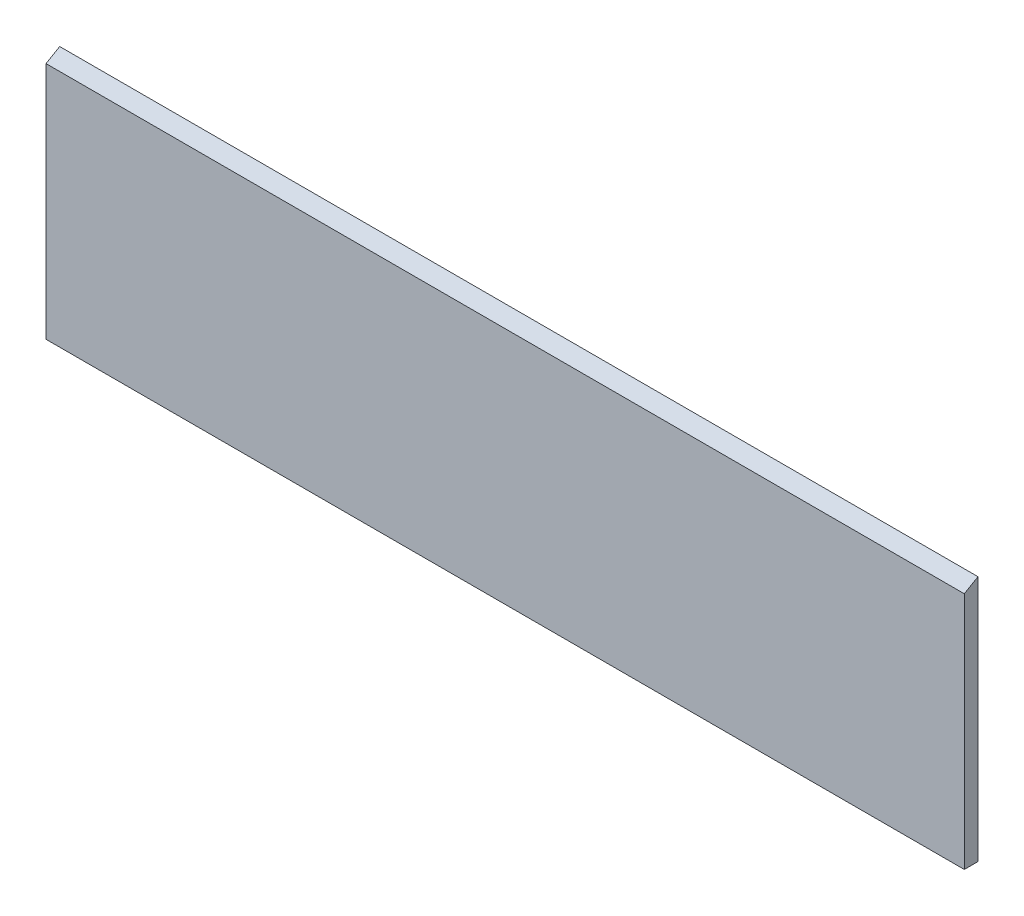
ISO-10303-21;
HEADER;
FILE_DESCRIPTION(('STEP AP214'),'2;1');
FILE_NAME('part.step','',(''),(''),'','','');
FILE_SCHEMA(('AUTOMOTIVE_DESIGN { 1 0 10303 214 1 1 1 1 }'));
ENDSEC;
DATA;
#1=APPLICATION_CONTEXT('core data for automotive mechanical design processes');
#2=APPLICATION_PROTOCOL_DEFINITION('international standard','automotive_design',2000,#1);
#3=PRODUCT_CONTEXT('',#1,'mechanical');
#4=PRODUCT('Part','Part','',(#3));
#5=PRODUCT_RELATED_PRODUCT_CATEGORY('part','',(#4));
#6=PRODUCT_DEFINITION_FORMATION('','',#4);
#7=PRODUCT_DEFINITION_CONTEXT('part definition',#1,'design');
#8=PRODUCT_DEFINITION('design','',#6,#7);
#9=PRODUCT_DEFINITION_SHAPE('','',#8);
#10=(LENGTH_UNIT() NAMED_UNIT(*) SI_UNIT(.MILLI.,.METRE.));
#11=(NAMED_UNIT(*) PLANE_ANGLE_UNIT() SI_UNIT($,.RADIAN.));
#12=(NAMED_UNIT(*) SI_UNIT($,.STERADIAN.) SOLID_ANGLE_UNIT());
#13=UNCERTAINTY_MEASURE_WITH_UNIT(LENGTH_MEASURE(1.E-05),#10,'distance_accuracy_value','');
#14=(GEOMETRIC_REPRESENTATION_CONTEXT(3) GLOBAL_UNCERTAINTY_ASSIGNED_CONTEXT((#13)) GLOBAL_UNIT_ASSIGNED_CONTEXT((#10,
#11,#12)) REPRESENTATION_CONTEXT('',''));
#15=CARTESIAN_POINT('',(0.,0.,0.));
#16=DIRECTION('',(0.,0.,1.));
#17=DIRECTION('',(1.,0.,0.));
#18=AXIS2_PLACEMENT_3D('',#15,#16,#17);
#19=CARTESIAN_POINT('',(0.,0.,10.));
#20=DIRECTION('',(1.,0.,0.));
#21=DIRECTION('',(0.,0.,-1.));
#22=AXIS2_PLACEMENT_3D('',#19,#20,#21);
#23=PLANE('',#22);
#24=DIRECTION('',(0.,-1.,0.));
#25=VECTOR('',#24,1.);
#26=CARTESIAN_POINT('',(0.,0.,10.));
#27=LINE('',#26,#25);
#28=CARTESIAN_POINT('',(0.,174.226497308104,9.99999999999999));
#29=VERTEX_POINT('',#28);
#30=CARTESIAN_POINT('',(0.,0.,10.));
#31=VERTEX_POINT('',#30);
#32=EDGE_CURVE('E88',#29,#31,#27,.T.);
#33=ORIENTED_EDGE('',*,*,#32,.F.);
#34=DIRECTION('',(0.,0.500000000000003,-0.866025403784437));
#35=VECTOR('',#34,1.);
#36=CARTESIAN_POINT('',(0.,180.,0.));
#37=LINE('',#36,#35);
#38=CARTESIAN_POINT('',(0.,180.,0.));
#39=VERTEX_POINT('',#38);
#40=EDGE_CURVE('E77',#29,#39,#37,.T.);
#41=ORIENTED_EDGE('',*,*,#40,.T.);
#42=DIRECTION('',(0.,-1.,0.));
#43=VECTOR('',#42,1.);
#44=CARTESIAN_POINT('',(0.,0.,0.));
#45=LINE('',#44,#43);
#46=CARTESIAN_POINT('',(0.,0.,0.));
#47=VERTEX_POINT('',#46);
#48=EDGE_CURVE('E87',#39,#47,#45,.T.);
#49=ORIENTED_EDGE('',*,*,#48,.T.);
#50=DIRECTION('',(0.,0.,-1.));
#51=VECTOR('',#50,1.);
#52=CARTESIAN_POINT('',(0.,0.,10.));
#53=LINE('',#52,#51);
#54=EDGE_CURVE('E11',#31,#47,#53,.T.);
#55=ORIENTED_EDGE('',*,*,#54,.F.);
#56=EDGE_LOOP('',(#33,#41,#49,#55));
#57=FACE_BOUND('',#56,.T.);
#58=ADVANCED_FACE('F31',(#57),#23,.F.);
#59=CARTESIAN_POINT('',(0.,0.,10.));
#60=DIRECTION('',(0.,1.,0.));
#61=DIRECTION('',(0.,0.,1.));
#62=AXIS2_PLACEMENT_3D('',#59,#60,#61);
#63=PLANE('',#62);
#64=DIRECTION('',(1.,0.,0.));
#65=VECTOR('',#64,1.);
#66=CARTESIAN_POINT('',(0.,0.,0.));
#67=LINE('',#66,#65);
#68=CARTESIAN_POINT('',(670.,0.,0.));
#69=VERTEX_POINT('',#68);
#70=EDGE_CURVE('E58',#47,#69,#67,.T.);
#71=ORIENTED_EDGE('',*,*,#70,.T.);
#72=DIRECTION('',(0.,0.,-1.));
#73=VECTOR('',#72,1.);
#74=CARTESIAN_POINT('',(670.,0.,10.));
#75=LINE('',#74,#73);
#76=CARTESIAN_POINT('',(670.,0.,10.));
#77=VERTEX_POINT('',#76);
#78=EDGE_CURVE('E39',#77,#69,#75,.T.);
#79=ORIENTED_EDGE('',*,*,#78,.F.);
#80=DIRECTION('',(1.,0.,0.));
#81=VECTOR('',#80,1.);
#82=CARTESIAN_POINT('',(0.,0.,10.));
#83=LINE('',#82,#81);
#84=EDGE_CURVE('E47',#31,#77,#83,.T.);
#85=ORIENTED_EDGE('',*,*,#84,.F.);
#86=ORIENTED_EDGE('',*,*,#54,.T.);
#87=EDGE_LOOP('',(#71,#79,#85,#86));
#88=FACE_BOUND('',#87,.T.);
#89=ADVANCED_FACE('F105',(#88),#63,.F.);
#90=CARTESIAN_POINT('',(670.,0.,10.));
#91=DIRECTION('',(-1.,0.,0.));
#92=DIRECTION('',(0.,0.,1.));
#93=AXIS2_PLACEMENT_3D('',#90,#91,#92);
#94=PLANE('',#93);
#95=DIRECTION('',(0.,1.,0.));
#96=VECTOR('',#95,1.);
#97=CARTESIAN_POINT('',(670.,0.,0.));
#98=LINE('',#97,#96);
#99=CARTESIAN_POINT('',(670.,180.,0.));
#100=VERTEX_POINT('',#99);
#101=EDGE_CURVE('E80',#69,#100,#98,.T.);
#102=ORIENTED_EDGE('',*,*,#101,.T.);
#103=DIRECTION('',(0.,0.500000000000003,-0.866025403784437));
#104=VECTOR('',#103,1.);
#105=CARTESIAN_POINT('',(670.,180.,0.));
#106=LINE('',#105,#104);
#107=CARTESIAN_POINT('',(670.,174.226497308104,9.99999999999999));
#108=VERTEX_POINT('',#107);
#109=EDGE_CURVE('E65',#108,#100,#106,.T.);
#110=ORIENTED_EDGE('',*,*,#109,.F.);
#111=DIRECTION('',(0.,1.,0.));
#112=VECTOR('',#111,1.);
#113=CARTESIAN_POINT('',(670.,0.,10.));
#114=LINE('',#113,#112);
#115=EDGE_CURVE('E92',#77,#108,#114,.T.);
#116=ORIENTED_EDGE('',*,*,#115,.F.);
#117=ORIENTED_EDGE('',*,*,#78,.T.);
#118=EDGE_LOOP('',(#102,#110,#116,#117));
#119=FACE_BOUND('',#118,.T.);
#120=ADVANCED_FACE('F81',(#119),#94,.F.);
#121=CARTESIAN_POINT('',(0.,180.,10.));
#122=DIRECTION('',(0.,0.,-1.));
#123=DIRECTION('',(-1.,0.,0.));
#124=AXIS2_PLACEMENT_3D('',#121,#122,#123);
#125=PLANE('',#124);
#126=ORIENTED_EDGE('',*,*,#115,.T.);
#127=DIRECTION('',(1.,0.,0.));
#128=VECTOR('',#127,1.);
#129=CARTESIAN_POINT('',(0.,174.226497308104,9.99999999999999));
#130=LINE('',#129,#128);
#131=EDGE_CURVE('E74',#29,#108,#130,.T.);
#132=ORIENTED_EDGE('',*,*,#131,.F.);
#133=ORIENTED_EDGE('',*,*,#32,.T.);
#134=ORIENTED_EDGE('',*,*,#84,.T.);
#135=EDGE_LOOP('',(#126,#132,#133,#134));
#136=FACE_BOUND('',#135,.T.);
#137=ADVANCED_FACE('F104',(#136),#125,.F.);
#138=CARTESIAN_POINT('',(0.,180.,0.));
#139=DIRECTION('',(0.,0.,-1.));
#140=DIRECTION('',(-1.,0.,0.));
#141=AXIS2_PLACEMENT_3D('',#138,#139,#140);
#142=PLANE('',#141);
#143=ORIENTED_EDGE('',*,*,#48,.F.);
#144=DIRECTION('',(-1.,0.,0.));
#145=VECTOR('',#144,1.);
#146=CARTESIAN_POINT('',(0.,180.,0.));
#147=LINE('',#146,#145);
#148=EDGE_CURVE('E70',#100,#39,#147,.T.);
#149=ORIENTED_EDGE('',*,*,#148,.F.);
#150=ORIENTED_EDGE('',*,*,#101,.F.);
#151=ORIENTED_EDGE('',*,*,#70,.F.);
#152=EDGE_LOOP('',(#143,#149,#150,#151));
#153=FACE_BOUND('',#152,.T.);
#154=ADVANCED_FACE('F85',(#153),#142,.T.);
#155=CARTESIAN_POINT('',(0.,180.,0.));
#156=DIRECTION('',(0.,-0.866025403784437,-0.500000000000003));
#157=DIRECTION('',(0.,0.500000000000003,-0.866025403784437));
#158=AXIS2_PLACEMENT_3D('',#155,#156,#157);
#159=PLANE('',#158);
#160=ORIENTED_EDGE('',*,*,#109,.T.);
#161=ORIENTED_EDGE('',*,*,#148,.T.);
#162=ORIENTED_EDGE('',*,*,#40,.F.);
#163=ORIENTED_EDGE('',*,*,#131,.T.);
#164=EDGE_LOOP('',(#160,#161,#162,#163));
#165=FACE_BOUND('',#164,.T.);
#166=ADVANCED_FACE('F67',(#165),#159,.F.);
#167=CLOSED_SHELL('',(#58,#89,#120,#137,#154,#166));
#168=MANIFOLD_SOLID_BREP('B2',#167);
#169=ADVANCED_BREP_SHAPE_REPRESENTATION('',(#18,#168),#14);
#170=SHAPE_DEFINITION_REPRESENTATION(#9,#169);
ENDSEC;
END-ISO-10303-21;
